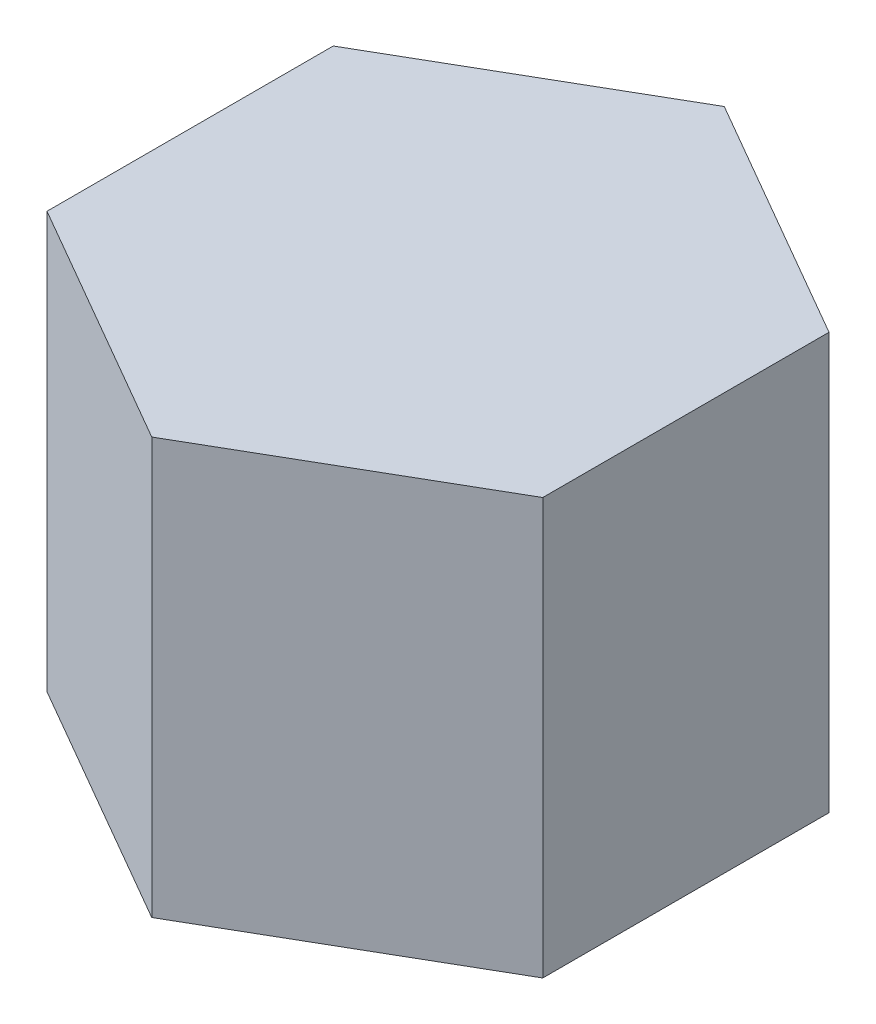
ISO-10303-21;
HEADER;
FILE_DESCRIPTION(('STEP AP214'),'2;1');
FILE_NAME('part.step','',(''),(''),'','','');
FILE_SCHEMA(('AUTOMOTIVE_DESIGN { 1 0 10303 214 1 1 1 1 }'));
ENDSEC;
DATA;
#1=APPLICATION_CONTEXT('core data for automotive mechanical design processes');
#2=APPLICATION_PROTOCOL_DEFINITION('international standard','automotive_design',2000,#1);
#3=PRODUCT_CONTEXT('',#1,'mechanical');
#4=PRODUCT('Part','Part','',(#3));
#5=PRODUCT_RELATED_PRODUCT_CATEGORY('part','',(#4));
#6=PRODUCT_DEFINITION_FORMATION('','',#4);
#7=PRODUCT_DEFINITION_CONTEXT('part definition',#1,'design');
#8=PRODUCT_DEFINITION('design','',#6,#7);
#9=PRODUCT_DEFINITION_SHAPE('','',#8);
#10=(LENGTH_UNIT() NAMED_UNIT(*) SI_UNIT(.MILLI.,.METRE.));
#11=(NAMED_UNIT(*) PLANE_ANGLE_UNIT() SI_UNIT($,.RADIAN.));
#12=(NAMED_UNIT(*) SI_UNIT($,.STERADIAN.) SOLID_ANGLE_UNIT());
#13=UNCERTAINTY_MEASURE_WITH_UNIT(LENGTH_MEASURE(1.E-05),#10,'distance_accuracy_value','');
#14=(GEOMETRIC_REPRESENTATION_CONTEXT(3) GLOBAL_UNCERTAINTY_ASSIGNED_CONTEXT((#13)) GLOBAL_UNIT_ASSIGNED_CONTEXT((#10,
#11,#12)) REPRESENTATION_CONTEXT('',''));
#15=CARTESIAN_POINT('',(0.,0.,0.));
#16=DIRECTION('',(0.,0.,1.));
#17=DIRECTION('',(1.,0.,0.));
#18=AXIS2_PLACEMENT_3D('',#15,#16,#17);
#19=CARTESIAN_POINT('',(210.339551417382,-147.556598747966,291.681971220494));
#20=DIRECTION('',(-0.499999999999909,0.,-0.866025403784491));
#21=DIRECTION('',(-0.866025403784491,0.,0.499999999999909));
#22=AXIS2_PLACEMENT_3D('',#19,#20,#21);
#23=PLANE('',#22);
#24=CARTESIAN_POINT('',(210.642660308706,-147.047793579175,291.506971220494));
#25=DIRECTION('',(-0.866025403784491,0.,0.499999999999909));
#26=VECTOR('',#25,1.);
#27=LINE('',#24,#26);
#28=CARTESIAN_POINT('',(210.642660308706,-147.047793579175,291.506971220494));
#29=VERTEX_POINT('',#28);
#30=CARTESIAN_POINT('',(210.339551417382,-147.047793579175,291.681971220494));
#31=VERTEX_POINT('',#30);
#32=EDGE_CURVE('E170',#29,#31,#27,.T.);
#33=ORIENTED_EDGE('',*,*,#32,.T.);
#34=CARTESIAN_POINT('',(210.339551417382,-147.556598747966,291.681971220494));
#35=DIRECTION('',(0.,1.,0.));
#36=VECTOR('',#35,1.);
#37=LINE('',#34,#36);
#38=CARTESIAN_POINT('',(210.339551417382,-147.556598747966,291.681971220494));
#39=VERTEX_POINT('',#38);
#40=EDGE_CURVE('E35',#39,#31,#37,.T.);
#41=ORIENTED_EDGE('',*,*,#40,.F.);
#42=CARTESIAN_POINT('',(210.642660308706,-147.556598747966,291.506971220494));
#43=DIRECTION('',(-0.866025403784491,0.,0.499999999999909));
#44=VECTOR('',#43,1.);
#45=LINE('',#42,#44);
#46=CARTESIAN_POINT('',(210.642660308706,-147.556598747966,291.506971220494));
#47=VERTEX_POINT('',#46);
#48=EDGE_CURVE('E159',#47,#39,#45,.T.);
#49=ORIENTED_EDGE('',*,*,#48,.F.);
#50=CARTESIAN_POINT('',(210.642660308706,-147.556598747966,291.506971220494));
#51=DIRECTION('',(0.,1.,0.));
#52=VECTOR('',#51,1.);
#53=LINE('',#50,#52);
#54=EDGE_CURVE('E10',#47,#29,#53,.T.);
#55=ORIENTED_EDGE('',*,*,#54,.T.);
#56=EDGE_LOOP('',(#33,#41,#49,#55));
#57=FACE_BOUND('',#56,.T.);
#58=ADVANCED_FACE('F16',(#57),#23,.F.);
#59=CARTESIAN_POINT('',(210.642660308706,-147.556598747966,291.594471220494));
#60=DIRECTION('',(-1.,0.,0.));
#61=DIRECTION('',(0.,-1.,0.));
#62=AXIS2_PLACEMENT_3D('',#59,#60,#61);
#63=PLANE('',#62);
#64=CARTESIAN_POINT('',(210.642660308706,-147.047793579175,291.156971220494));
#65=DIRECTION('',(0.,0.,1.));
#66=VECTOR('',#65,1.);
#67=LINE('',#64,#66);
#68=CARTESIAN_POINT('',(210.642660308706,-147.047793579175,291.156971220494));
#69=VERTEX_POINT('',#68);
#70=EDGE_CURVE('E167',#69,#29,#67,.T.);
#71=ORIENTED_EDGE('',*,*,#70,.T.);
#72=ORIENTED_EDGE('',*,*,#54,.F.);
#73=CARTESIAN_POINT('',(210.642660308706,-147.556598747966,291.156971220494));
#74=DIRECTION('',(0.,0.,1.));
#75=VECTOR('',#74,1.);
#76=LINE('',#73,#75);
#77=CARTESIAN_POINT('',(210.642660308706,-147.556598747966,291.156971220494));
#78=VERTEX_POINT('',#77);
#79=EDGE_CURVE('E156',#78,#47,#76,.T.);
#80=ORIENTED_EDGE('',*,*,#79,.F.);
#81=CARTESIAN_POINT('',(210.642660308706,-147.556598747966,291.156971220494));
#82=DIRECTION('',(0.,1.,0.));
#83=VECTOR('',#82,1.);
#84=LINE('',#81,#83);
#85=EDGE_CURVE('E27',#78,#69,#84,.T.);
#86=ORIENTED_EDGE('',*,*,#85,.T.);
#87=EDGE_LOOP('',(#71,#72,#80,#86));
#88=FACE_BOUND('',#87,.T.);
#89=ADVANCED_FACE('F189',(#88),#63,.F.);
#90=CARTESIAN_POINT('',(210.642660308706,-147.556598747966,291.156971220494));
#91=DIRECTION('',(-0.499999999999943,0.,0.866025403784471));
#92=DIRECTION('',(0.866025403784471,0.,0.499999999999943));
#93=AXIS2_PLACEMENT_3D('',#90,#91,#92);
#94=PLANE('',#93);
#95=CARTESIAN_POINT('',(210.339551417382,-147.047793579175,290.981971220494));
#96=DIRECTION('',(0.866025403784471,0.,0.499999999999943));
#97=VECTOR('',#96,1.);
#98=LINE('',#95,#97);
#99=CARTESIAN_POINT('',(210.339551417382,-147.047793579175,290.981971220494));
#100=VERTEX_POINT('',#99);
#101=EDGE_CURVE('E163',#100,#69,#98,.T.);
#102=ORIENTED_EDGE('',*,*,#101,.T.);
#103=ORIENTED_EDGE('',*,*,#85,.F.);
#104=CARTESIAN_POINT('',(210.339551417382,-147.556598747966,290.981971220494));
#105=DIRECTION('',(0.866025403784471,0.,0.499999999999943));
#106=VECTOR('',#105,1.);
#107=LINE('',#104,#106);
#108=CARTESIAN_POINT('',(210.339551417382,-147.556598747966,290.981971220494));
#109=VERTEX_POINT('',#108);
#110=EDGE_CURVE('E106',#109,#78,#107,.T.);
#111=ORIENTED_EDGE('',*,*,#110,.F.);
#112=CARTESIAN_POINT('',(210.339551417382,-147.556598747966,290.981971220494));
#113=DIRECTION('',(0.,1.,0.));
#114=VECTOR('',#113,1.);
#115=LINE('',#112,#114);
#116=EDGE_CURVE('E94',#109,#100,#115,.T.);
#117=ORIENTED_EDGE('',*,*,#116,.T.);
#118=EDGE_LOOP('',(#102,#103,#111,#117));
#119=FACE_BOUND('',#118,.T.);
#120=ADVANCED_FACE('F198',(#119),#94,.F.);
#121=CARTESIAN_POINT('',(210.339551417382,-147.556598747966,290.981971220494));
#122=DIRECTION('',(0.499999999999978,0.,0.866025403784452));
#123=DIRECTION('',(0.866025403784452,0.,-0.499999999999978));
#124=AXIS2_PLACEMENT_3D('',#121,#122,#123);
#125=PLANE('',#124);
#126=CARTESIAN_POINT('',(210.036442526057,-147.047793579175,291.156971220494));
#127=DIRECTION('',(0.866025403784452,0.,-0.499999999999978));
#128=VECTOR('',#127,1.);
#129=LINE('',#126,#128);
#130=CARTESIAN_POINT('',(210.036442526057,-147.047793579175,291.156971220494));
#131=VERTEX_POINT('',#130);
#132=EDGE_CURVE('E162',#131,#100,#129,.T.);
#133=ORIENTED_EDGE('',*,*,#132,.T.);
#134=ORIENTED_EDGE('',*,*,#116,.F.);
#135=CARTESIAN_POINT('',(210.036442526057,-147.556598747966,291.156971220494));
#136=DIRECTION('',(0.866025403784452,0.,-0.499999999999978));
#137=VECTOR('',#136,1.);
#138=LINE('',#135,#137);
#139=CARTESIAN_POINT('',(210.036442526057,-147.556598747966,291.156971220494));
#140=VERTEX_POINT('',#139);
#141=EDGE_CURVE('E98',#140,#109,#138,.T.);
#142=ORIENTED_EDGE('',*,*,#141,.F.);
#143=CARTESIAN_POINT('',(210.036442526057,-147.556598747966,291.156971220494));
#144=DIRECTION('',(0.,1.,0.));
#145=VECTOR('',#144,1.);
#146=LINE('',#143,#145);
#147=EDGE_CURVE('E79',#140,#131,#146,.T.);
#148=ORIENTED_EDGE('',*,*,#147,.T.);
#149=EDGE_LOOP('',(#133,#134,#142,#148));
#150=FACE_BOUND('',#149,.T.);
#151=ADVANCED_FACE('F100',(#150),#125,.F.);
#152=CARTESIAN_POINT('',(210.036442526057,-147.556598747966,291.594471220494));
#153=DIRECTION('',(1.,0.,0.));
#154=DIRECTION('',(0.,1.,0.));
#155=AXIS2_PLACEMENT_3D('',#152,#153,#154);
#156=PLANE('',#155);
#157=CARTESIAN_POINT('',(210.036442526057,-147.047793579175,291.506971220494));
#158=DIRECTION('',(0.,0.,-1.));
#159=VECTOR('',#158,1.);
#160=LINE('',#157,#159);
#161=CARTESIAN_POINT('',(210.036442526057,-147.047793579175,291.506971220494));
#162=VERTEX_POINT('',#161);
#163=EDGE_CURVE('E88',#162,#131,#160,.T.);
#164=ORIENTED_EDGE('',*,*,#163,.T.);
#165=ORIENTED_EDGE('',*,*,#147,.F.);
#166=CARTESIAN_POINT('',(210.036442526057,-147.556598747966,291.506971220494));
#167=DIRECTION('',(0.,0.,-1.));
#168=VECTOR('',#167,1.);
#169=LINE('',#166,#168);
#170=CARTESIAN_POINT('',(210.036442526057,-147.556598747966,291.506971220494));
#171=VERTEX_POINT('',#170);
#172=EDGE_CURVE('E84',#171,#140,#169,.T.);
#173=ORIENTED_EDGE('',*,*,#172,.F.);
#174=CARTESIAN_POINT('',(210.036442526057,-147.556598747966,291.506971220494));
#175=DIRECTION('',(0.,1.,0.));
#176=VECTOR('',#175,1.);
#177=LINE('',#174,#176);
#178=EDGE_CURVE('E58',#171,#162,#177,.T.);
#179=ORIENTED_EDGE('',*,*,#178,.T.);
#180=EDGE_LOOP('',(#164,#165,#173,#179));
#181=FACE_BOUND('',#180,.T.);
#182=ADVANCED_FACE('F82',(#181),#156,.F.);
#183=CARTESIAN_POINT('',(210.036442526057,-147.556598747966,291.506971220494));
#184=DIRECTION('',(0.499999999999978,0.,-0.866025403784452));
#185=DIRECTION('',(-0.866025403784452,0.,-0.499999999999978));
#186=AXIS2_PLACEMENT_3D('',#183,#184,#185);
#187=PLANE('',#186);
#188=CARTESIAN_POINT('',(210.339551417382,-147.047793579175,291.681971220494));
#189=DIRECTION('',(-0.866025403784452,0.,-0.499999999999978));
#190=VECTOR('',#189,1.);
#191=LINE('',#188,#190);
#192=EDGE_CURVE('E160',#31,#162,#191,.T.);
#193=ORIENTED_EDGE('',*,*,#192,.T.);
#194=ORIENTED_EDGE('',*,*,#178,.F.);
#195=CARTESIAN_POINT('',(210.339551417382,-147.556598747966,291.681971220494));
#196=DIRECTION('',(-0.866025403784452,0.,-0.499999999999978));
#197=VECTOR('',#196,1.);
#198=LINE('',#195,#197);
#199=EDGE_CURVE('E112',#39,#171,#198,.T.);
#200=ORIENTED_EDGE('',*,*,#199,.F.);
#201=ORIENTED_EDGE('',*,*,#40,.T.);
#202=EDGE_LOOP('',(#193,#194,#200,#201));
#203=FACE_BOUND('',#202,.T.);
#204=ADVANCED_FACE('F131',(#203),#187,.F.);
#205=CARTESIAN_POINT('',(206.491105863044,-147.556598747966,291.594471220494));
#206=DIRECTION('',(0.,1.,0.));
#207=DIRECTION('',(-1.,0.,0.));
#208=AXIS2_PLACEMENT_3D('',#205,#206,#207);
#209=PLANE('',#208);
#210=ORIENTED_EDGE('',*,*,#48,.T.);
#211=ORIENTED_EDGE('',*,*,#199,.T.);
#212=ORIENTED_EDGE('',*,*,#172,.T.);
#213=ORIENTED_EDGE('',*,*,#141,.T.);
#214=ORIENTED_EDGE('',*,*,#110,.T.);
#215=ORIENTED_EDGE('',*,*,#79,.T.);
#216=EDGE_LOOP('',(#210,#211,#212,#213,#214,#215));
#217=FACE_BOUND('',#216,.T.);
#218=ADVANCED_FACE('F111',(#217),#209,.F.);
#219=CARTESIAN_POINT('',(206.491105863044,-147.047793579175,291.594471220494));
#220=DIRECTION('',(0.,1.,0.));
#221=DIRECTION('',(-1.,0.,0.));
#222=AXIS2_PLACEMENT_3D('',#219,#220,#221);
#223=PLANE('',#222);
#224=ORIENTED_EDGE('',*,*,#32,.F.);
#225=ORIENTED_EDGE('',*,*,#70,.F.);
#226=ORIENTED_EDGE('',*,*,#101,.F.);
#227=ORIENTED_EDGE('',*,*,#132,.F.);
#228=ORIENTED_EDGE('',*,*,#163,.F.);
#229=ORIENTED_EDGE('',*,*,#192,.F.);
#230=EDGE_LOOP('',(#224,#225,#226,#227,#228,#229));
#231=FACE_BOUND('',#230,.T.);
#232=ADVANCED_FACE('F130',(#231),#223,.T.);
#233=CLOSED_SHELL('',(#58,#89,#120,#151,#182,#204,#218,#232));
#234=MANIFOLD_SOLID_BREP('B1',#233);
#235=ADVANCED_BREP_SHAPE_REPRESENTATION('',(#18,#234),#14);
#236=SHAPE_DEFINITION_REPRESENTATION(#9,#235);
ENDSEC;
END-ISO-10303-21;
